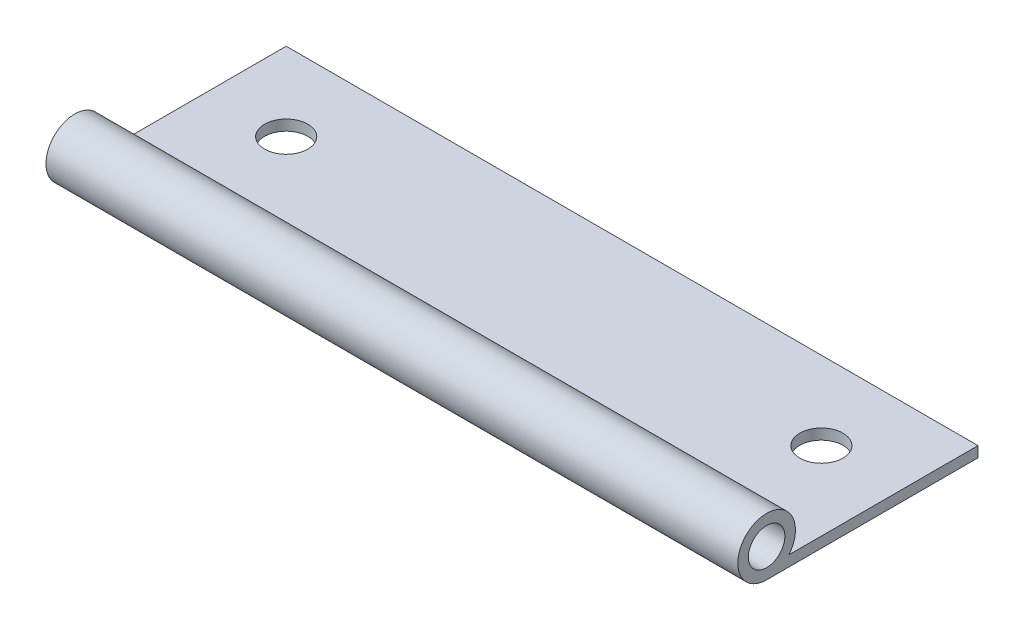
ISO-10303-21;
HEADER;
FILE_DESCRIPTION(('STEP AP214'),'2;1');
FILE_NAME('part.step','',(''),(''),'','','');
FILE_SCHEMA(('AUTOMOTIVE_DESIGN { 1 0 10303 214 1 1 1 1 }'));
ENDSEC;
DATA;
#1=APPLICATION_CONTEXT('core data for automotive mechanical design processes');
#2=APPLICATION_PROTOCOL_DEFINITION('international standard','automotive_design',2000,#1);
#3=PRODUCT_CONTEXT('',#1,'mechanical');
#4=PRODUCT('Part','Part','',(#3));
#5=PRODUCT_RELATED_PRODUCT_CATEGORY('part','',(#4));
#6=PRODUCT_DEFINITION_FORMATION('','',#4);
#7=PRODUCT_DEFINITION_CONTEXT('part definition',#1,'design');
#8=PRODUCT_DEFINITION('design','',#6,#7);
#9=PRODUCT_DEFINITION_SHAPE('','',#8);
#10=(LENGTH_UNIT() NAMED_UNIT(*) SI_UNIT(.MILLI.,.METRE.));
#11=(NAMED_UNIT(*) PLANE_ANGLE_UNIT() SI_UNIT($,.RADIAN.));
#12=(NAMED_UNIT(*) SI_UNIT($,.STERADIAN.) SOLID_ANGLE_UNIT());
#13=UNCERTAINTY_MEASURE_WITH_UNIT(LENGTH_MEASURE(1.E-05),#10,'distance_accuracy_value','');
#14=(GEOMETRIC_REPRESENTATION_CONTEXT(3) GLOBAL_UNCERTAINTY_ASSIGNED_CONTEXT((#13)) GLOBAL_UNIT_ASSIGNED_CONTEXT((#10,
#11,#12)) REPRESENTATION_CONTEXT('',''));
#15=CARTESIAN_POINT('',(0.,0.,0.));
#16=DIRECTION('',(0.,0.,1.));
#17=DIRECTION('',(1.,0.,0.));
#18=AXIS2_PLACEMENT_3D('',#15,#16,#17);
#19=CARTESIAN_POINT('',(72.,1.9,3.));
#20=DIRECTION('',(1.,0.,0.));
#21=DIRECTION('',(0.,0.,-1.));
#22=AXIS2_PLACEMENT_3D('',#19,#20,#21);
#23=PLANE('',#22);
#24=DIRECTION('',(0.,0.,1.));
#25=VECTOR('',#24,1.);
#26=CARTESIAN_POINT('',(72.,0.,0.));
#27=LINE('',#26,#25);
#28=CARTESIAN_POINT('',(72.,0.,-19.));
#29=VERTEX_POINT('',#28);
#30=CARTESIAN_POINT('',(72.,0.,0.678362646751216));
#31=VERTEX_POINT('',#30);
#32=EDGE_CURVE('E51',#29,#31,#27,.T.);
#33=ORIENTED_EDGE('',*,*,#32,.T.);
#34=CARTESIAN_POINT('',(72.,1.9,3.));
#35=DIRECTION('',(1.,0.,0.));
#36=DIRECTION('',(0.,0.,-1.));
#37=AXIS2_PLACEMENT_3D('',#34,#35,#36);
#38=CIRCLE('',#37,3.);
#39=CARTESIAN_POINT('',(72.,-1.1,3.));
#40=VERTEX_POINT('',#39);
#41=EDGE_CURVE('E81',#31,#40,#38,.T.);
#42=ORIENTED_EDGE('',*,*,#41,.T.);
#43=DIRECTION('',(0.,0.,-1.));
#44=VECTOR('',#43,1.);
#45=CARTESIAN_POINT('',(72.,-1.1,0.));
#46=LINE('',#45,#44);
#47=CARTESIAN_POINT('',(72.,-1.1,-19.));
#48=VERTEX_POINT('',#47);
#49=EDGE_CURVE('E85',#40,#48,#46,.T.);
#50=ORIENTED_EDGE('',*,*,#49,.T.);
#51=DIRECTION('',(0.,1.,0.));
#52=VECTOR('',#51,1.);
#53=CARTESIAN_POINT('',(72.,0.,-19.));
#54=LINE('',#53,#52);
#55=EDGE_CURVE('E93',#48,#29,#54,.T.);
#56=ORIENTED_EDGE('',*,*,#55,.T.);
#57=EDGE_LOOP('',(#33,#42,#50,#56));
#58=FACE_BOUND('',#57,.T.);
#59=CARTESIAN_POINT('',(72.,1.9,3.));
#60=DIRECTION('',(1.,0.,0.));
#61=DIRECTION('',(0.,0.,-1.));
#62=AXIS2_PLACEMENT_3D('',#59,#60,#61);
#63=CIRCLE('',#62,1.9);
#64=CARTESIAN_POINT('',(72.,1.9,1.1));
#65=VERTEX_POINT('',#64);
#66=EDGE_CURVE('E100',#65,#65,#63,.T.);
#67=ORIENTED_EDGE('',*,*,#66,.F.);
#68=EDGE_LOOP('',(#67));
#69=FACE_BOUND('',#68,.T.);
#70=ADVANCED_FACE('F34',(#58,#69),#23,.T.);
#71=CARTESIAN_POINT('',(0.,1.9,3.));
#72=DIRECTION('',(1.,0.,0.));
#73=DIRECTION('',(0.,0.,-1.));
#74=AXIS2_PLACEMENT_3D('',#71,#72,#73);
#75=PLANE('',#74);
#76=CARTESIAN_POINT('',(0.,1.9,3.));
#77=DIRECTION('',(1.,0.,0.));
#78=DIRECTION('',(0.,0.,-1.));
#79=AXIS2_PLACEMENT_3D('',#76,#77,#78);
#80=CIRCLE('',#79,3.);
#81=CARTESIAN_POINT('',(0.,0.,0.678362646751216));
#82=VERTEX_POINT('',#81);
#83=CARTESIAN_POINT('',(0.,-1.1,3.));
#84=VERTEX_POINT('',#83);
#85=EDGE_CURVE('E89',#82,#84,#80,.T.);
#86=ORIENTED_EDGE('',*,*,#85,.F.);
#87=DIRECTION('',(0.,0.,1.));
#88=VECTOR('',#87,1.);
#89=CARTESIAN_POINT('',(0.,0.,0.));
#90=LINE('',#89,#88);
#91=CARTESIAN_POINT('',(0.,0.,-19.));
#92=VERTEX_POINT('',#91);
#93=EDGE_CURVE('E103',#92,#82,#90,.T.);
#94=ORIENTED_EDGE('',*,*,#93,.F.);
#95=DIRECTION('',(0.,1.,0.));
#96=VECTOR('',#95,1.);
#97=CARTESIAN_POINT('',(0.,0.,-19.));
#98=LINE('',#97,#96);
#99=CARTESIAN_POINT('',(0.,-1.1,-19.));
#100=VERTEX_POINT('',#99);
#101=EDGE_CURVE('E75',#100,#92,#98,.T.);
#102=ORIENTED_EDGE('',*,*,#101,.F.);
#103=DIRECTION('',(0.,0.,-1.));
#104=VECTOR('',#103,1.);
#105=CARTESIAN_POINT('',(0.,-1.1,-19.));
#106=LINE('',#105,#104);
#107=EDGE_CURVE('E68',#84,#100,#106,.T.);
#108=ORIENTED_EDGE('',*,*,#107,.F.);
#109=EDGE_LOOP('',(#86,#94,#102,#108));
#110=FACE_BOUND('',#109,.T.);
#111=CARTESIAN_POINT('',(0.,1.9,3.));
#112=DIRECTION('',(1.,0.,0.));
#113=DIRECTION('',(0.,0.,-1.));
#114=AXIS2_PLACEMENT_3D('',#111,#112,#113);
#115=CIRCLE('',#114,1.9);
#116=CARTESIAN_POINT('',(0.,1.9,1.1));
#117=VERTEX_POINT('',#116);
#118=EDGE_CURVE('E154',#117,#117,#115,.T.);
#119=ORIENTED_EDGE('',*,*,#118,.T.);
#120=EDGE_LOOP('',(#119));
#121=FACE_BOUND('',#120,.T.);
#122=ADVANCED_FACE('F109',(#110,#121),#75,.F.);
#123=CARTESIAN_POINT('',(72.,1.9,3.));
#124=DIRECTION('',(-1.,0.,0.));
#125=DIRECTION('',(0.,0.,1.));
#126=AXIS2_PLACEMENT_3D('',#123,#124,#125);
#127=CYLINDRICAL_SURFACE('',#126,3.);
#128=ORIENTED_EDGE('',*,*,#85,.T.);
#129=DIRECTION('',(-1.,0.,0.));
#130=VECTOR('',#129,1.);
#131=CARTESIAN_POINT('',(72.,-1.1,3.));
#132=LINE('',#131,#130);
#133=EDGE_CURVE('E43',#40,#84,#132,.T.);
#134=ORIENTED_EDGE('',*,*,#133,.F.);
#135=ORIENTED_EDGE('',*,*,#41,.F.);
#136=DIRECTION('',(-1.,0.,0.));
#137=VECTOR('',#136,1.);
#138=CARTESIAN_POINT('',(72.,0.,0.678362646751216));
#139=LINE('',#138,#137);
#140=EDGE_CURVE('E11',#31,#82,#139,.T.);
#141=ORIENTED_EDGE('',*,*,#140,.T.);
#142=EDGE_LOOP('',(#128,#134,#135,#141));
#143=FACE_BOUND('',#142,.T.);
#144=ADVANCED_FACE('F36',(#143),#127,.T.);
#145=CARTESIAN_POINT('',(72.,-1.1,-19.));
#146=DIRECTION('',(0.,1.,0.));
#147=DIRECTION('',(0.,0.,1.));
#148=AXIS2_PLACEMENT_3D('',#145,#146,#147);
#149=PLANE('',#148);
#150=CARTESIAN_POINT('',(63.85,-1.1,-10.85));
#151=DIRECTION('',(0.,1.,0.));
#152=DIRECTION('',(0.,0.,-1.));
#153=AXIS2_PLACEMENT_3D('',#150,#151,#152);
#154=CIRCLE('',#153,2.25);
#155=CARTESIAN_POINT('',(63.85,-1.1,-13.1));
#156=VERTEX_POINT('',#155);
#157=EDGE_CURVE('E144',#156,#156,#154,.T.);
#158=ORIENTED_EDGE('',*,*,#157,.T.);
#159=EDGE_LOOP('',(#158));
#160=FACE_BOUND('',#159,.T.);
#161=CARTESIAN_POINT('',(8.15,-1.1,-10.85));
#162=DIRECTION('',(0.,1.,0.));
#163=DIRECTION('',(0.,0.,1.));
#164=AXIS2_PLACEMENT_3D('',#161,#162,#163);
#165=CIRCLE('',#164,2.25);
#166=CARTESIAN_POINT('',(8.15,-1.1,-8.6));
#167=VERTEX_POINT('',#166);
#168=EDGE_CURVE('E151',#167,#167,#165,.T.);
#169=ORIENTED_EDGE('',*,*,#168,.T.);
#170=EDGE_LOOP('',(#169));
#171=FACE_BOUND('',#170,.T.);
#172=ORIENTED_EDGE('',*,*,#107,.T.);
#173=DIRECTION('',(-1.,0.,0.));
#174=VECTOR('',#173,1.);
#175=CARTESIAN_POINT('',(72.,-1.1,-19.));
#176=LINE('',#175,#174);
#177=EDGE_CURVE('E90',#48,#100,#176,.T.);
#178=ORIENTED_EDGE('',*,*,#177,.F.);
#179=ORIENTED_EDGE('',*,*,#49,.F.);
#180=ORIENTED_EDGE('',*,*,#133,.T.);
#181=EDGE_LOOP('',(#172,#178,#179,#180));
#182=FACE_BOUND('',#181,.T.);
#183=ADVANCED_FACE('F91',(#160,#171,#182),#149,.F.);
#184=CARTESIAN_POINT('',(72.,0.,-19.));
#185=DIRECTION('',(0.,0.,1.));
#186=DIRECTION('',(1.,0.,0.));
#187=AXIS2_PLACEMENT_3D('',#184,#185,#186);
#188=PLANE('',#187);
#189=ORIENTED_EDGE('',*,*,#101,.T.);
#190=DIRECTION('',(-1.,0.,0.));
#191=VECTOR('',#190,1.);
#192=CARTESIAN_POINT('',(72.,0.,-19.));
#193=LINE('',#192,#191);
#194=EDGE_CURVE('E95',#29,#92,#193,.T.);
#195=ORIENTED_EDGE('',*,*,#194,.F.);
#196=ORIENTED_EDGE('',*,*,#55,.F.);
#197=ORIENTED_EDGE('',*,*,#177,.T.);
#198=EDGE_LOOP('',(#189,#195,#196,#197));
#199=FACE_BOUND('',#198,.T.);
#200=ADVANCED_FACE('F106',(#199),#188,.F.);
#201=CARTESIAN_POINT('',(72.,0.,0.));
#202=DIRECTION('',(0.,-1.,0.));
#203=DIRECTION('',(0.,0.,-1.));
#204=AXIS2_PLACEMENT_3D('',#201,#202,#203);
#205=PLANE('',#204);
#206=CARTESIAN_POINT('',(63.85,0.,-10.85));
#207=DIRECTION('',(0.,1.,0.));
#208=DIRECTION('',(0.,0.,-1.));
#209=AXIS2_PLACEMENT_3D('',#206,#207,#208);
#210=CIRCLE('',#209,2.25);
#211=CARTESIAN_POINT('',(63.85,0.,-13.1));
#212=VERTEX_POINT('',#211);
#213=EDGE_CURVE('E146',#212,#212,#210,.T.);
#214=ORIENTED_EDGE('',*,*,#213,.F.);
#215=EDGE_LOOP('',(#214));
#216=FACE_BOUND('',#215,.T.);
#217=CARTESIAN_POINT('',(8.15,0.,-10.85));
#218=DIRECTION('',(0.,1.,0.));
#219=DIRECTION('',(0.,0.,1.));
#220=AXIS2_PLACEMENT_3D('',#217,#218,#219);
#221=CIRCLE('',#220,2.25);
#222=CARTESIAN_POINT('',(8.15,0.,-8.6));
#223=VERTEX_POINT('',#222);
#224=EDGE_CURVE('E148',#223,#223,#221,.T.);
#225=ORIENTED_EDGE('',*,*,#224,.F.);
#226=EDGE_LOOP('',(#225));
#227=FACE_BOUND('',#226,.T.);
#228=ORIENTED_EDGE('',*,*,#93,.T.);
#229=ORIENTED_EDGE('',*,*,#140,.F.);
#230=ORIENTED_EDGE('',*,*,#32,.F.);
#231=ORIENTED_EDGE('',*,*,#194,.T.);
#232=EDGE_LOOP('',(#228,#229,#230,#231));
#233=FACE_BOUND('',#232,.T.);
#234=ADVANCED_FACE('F111',(#216,#227,#233),#205,.F.);
#235=CARTESIAN_POINT('',(72.,1.9,3.));
#236=DIRECTION('',(-1.,0.,0.));
#237=DIRECTION('',(0.,0.,1.));
#238=AXIS2_PLACEMENT_3D('',#235,#236,#237);
#239=CYLINDRICAL_SURFACE('',#238,1.9);
#240=ORIENTED_EDGE('',*,*,#66,.T.);
#241=EDGE_LOOP('',(#240));
#242=FACE_BOUND('',#241,.T.);
#243=ORIENTED_EDGE('',*,*,#118,.F.);
#244=EDGE_LOOP('',(#243));
#245=FACE_BOUND('',#244,.T.);
#246=ADVANCED_FACE('F113',(#242,#245),#239,.F.);
#247=CARTESIAN_POINT('',(8.15,-1.1,-10.85));
#248=DIRECTION('',(0.,1.,0.));
#249=DIRECTION('',(0.,0.,1.));
#250=AXIS2_PLACEMENT_3D('',#247,#248,#249);
#251=CYLINDRICAL_SURFACE('',#250,2.25);
#252=ORIENTED_EDGE('',*,*,#168,.F.);
#253=EDGE_LOOP('',(#252));
#254=FACE_BOUND('',#253,.T.);
#255=ORIENTED_EDGE('',*,*,#224,.T.);
#256=EDGE_LOOP('',(#255));
#257=FACE_BOUND('',#256,.T.);
#258=ADVANCED_FACE('F120',(#254,#257),#251,.F.);
#259=CARTESIAN_POINT('',(63.85,-1.1,-10.85));
#260=DIRECTION('',(0.,1.,0.));
#261=DIRECTION('',(0.,0.,1.));
#262=AXIS2_PLACEMENT_3D('',#259,#260,#261);
#263=CYLINDRICAL_SURFACE('',#262,2.25);
#264=ORIENTED_EDGE('',*,*,#157,.F.);
#265=EDGE_LOOP('',(#264));
#266=FACE_BOUND('',#265,.T.);
#267=ORIENTED_EDGE('',*,*,#213,.T.);
#268=EDGE_LOOP('',(#267));
#269=FACE_BOUND('',#268,.T.);
#270=ADVANCED_FACE('F135',(#266,#269),#263,.F.);
#271=CLOSED_SHELL('',(#70,#122,#144,#183,#200,#234,#246,#258,#270));
#272=MANIFOLD_SOLID_BREP('B2',#271);
#273=ADVANCED_BREP_SHAPE_REPRESENTATION('',(#18,#272),#14);
#274=SHAPE_DEFINITION_REPRESENTATION(#9,#273);
ENDSEC;
END-ISO-10303-21;
